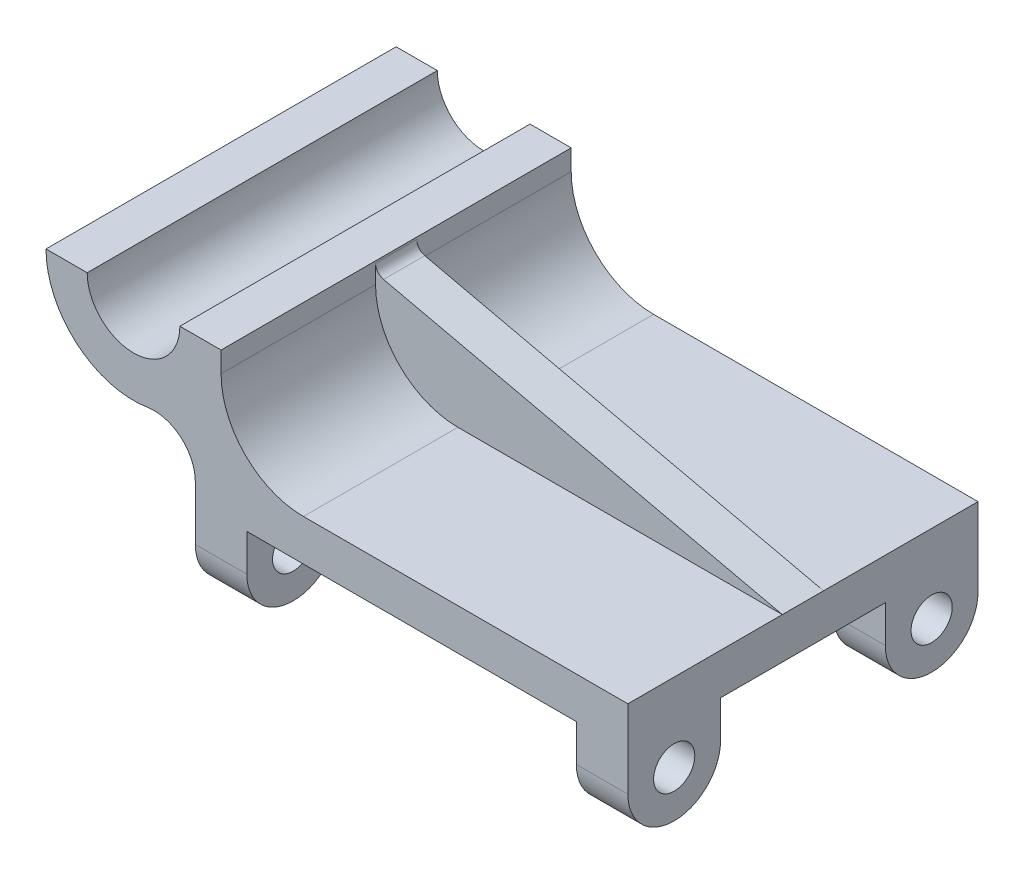
ISO-10303-21;
HEADER;
FILE_DESCRIPTION(('STEP AP214'),'2;1');
FILE_NAME('part.step','',(''),(''),'','','');
FILE_SCHEMA(('AUTOMOTIVE_DESIGN { 1 0 10303 214 1 1 1 1 }'));
ENDSEC;
DATA;
#1=APPLICATION_CONTEXT('core data for automotive mechanical design processes');
#2=APPLICATION_PROTOCOL_DEFINITION('international standard','automotive_design',2000,#1);
#3=PRODUCT_CONTEXT('',#1,'mechanical');
#4=PRODUCT('Part','Part','',(#3));
#5=PRODUCT_RELATED_PRODUCT_CATEGORY('part','',(#4));
#6=PRODUCT_DEFINITION_FORMATION('','',#4);
#7=PRODUCT_DEFINITION_CONTEXT('part definition',#1,'design');
#8=PRODUCT_DEFINITION('design','',#6,#7);
#9=PRODUCT_DEFINITION_SHAPE('','',#8);
#10=(LENGTH_UNIT() NAMED_UNIT(*) SI_UNIT(.MILLI.,.METRE.));
#11=(NAMED_UNIT(*) PLANE_ANGLE_UNIT() SI_UNIT($,.RADIAN.));
#12=(NAMED_UNIT(*) SI_UNIT($,.STERADIAN.) SOLID_ANGLE_UNIT());
#13=UNCERTAINTY_MEASURE_WITH_UNIT(LENGTH_MEASURE(1.E-05),#10,'distance_accuracy_value','');
#14=(GEOMETRIC_REPRESENTATION_CONTEXT(3) GLOBAL_UNCERTAINTY_ASSIGNED_CONTEXT((#13)) GLOBAL_UNIT_ASSIGNED_CONTEXT((#10,
#11,#12)) REPRESENTATION_CONTEXT('',''));
#15=CARTESIAN_POINT('',(0.,0.,0.));
#16=DIRECTION('',(0.,0.,1.));
#17=DIRECTION('',(1.,0.,0.));
#18=AXIS2_PLACEMENT_3D('',#15,#16,#17);
#19=CARTESIAN_POINT('',(20.6375,38.1,53.975));
#20=DIRECTION('',(0.,0.,-1.));
#21=DIRECTION('',(-1.,0.,0.));
#22=AXIS2_PLACEMENT_3D('',#19,#20,#21);
#23=CYLINDRICAL_SURFACE('',#22,25.4);
#24=CARTESIAN_POINT('',(20.6375,38.1,-6.35));
#25=DIRECTION('',(0.,0.,1.));
#26=DIRECTION('',(1.,0.,0.));
#27=AXIS2_PLACEMENT_3D('',#24,#25,#26);
#28=CIRCLE('',#27,25.4);
#29=CARTESIAN_POINT('',(20.6375000000002,12.7,-6.35));
#30=VERTEX_POINT('',#29);
#31=CARTESIAN_POINT('',(-4.76250000000001,38.1000000000002,-6.35));
#32=VERTEX_POINT('',#31);
#33=EDGE_CURVE('E234',#30,#32,#28,.F.);
#34=ORIENTED_EDGE('',*,*,#33,.F.);
#35=DIRECTION('',(0.,0.,-1.));
#36=VECTOR('',#35,1.);
#37=CARTESIAN_POINT('',(20.6375000000002,12.7,53.975));
#38=LINE('',#37,#36);
#39=CARTESIAN_POINT('',(20.6375000000002,12.7,-53.975));
#40=VERTEX_POINT('',#39);
#41=EDGE_CURVE('E218',#30,#40,#38,.T.);
#42=ORIENTED_EDGE('',*,*,#41,.T.);
#43=CARTESIAN_POINT('',(20.6375,38.1,-53.975));
#44=DIRECTION('',(0.,0.,-1.));
#45=DIRECTION('',(-1.,0.,0.));
#46=AXIS2_PLACEMENT_3D('',#43,#44,#45);
#47=CIRCLE('',#46,25.4);
#48=CARTESIAN_POINT('',(-4.76250000000001,38.1000000000002,-53.975));
#49=VERTEX_POINT('',#48);
#50=EDGE_CURVE('E534',#40,#49,#47,.T.);
#51=ORIENTED_EDGE('',*,*,#50,.T.);
#52=DIRECTION('',(0.,0.,-1.));
#53=VECTOR('',#52,1.);
#54=CARTESIAN_POINT('',(-4.76250000000001,38.1000000000002,53.975));
#55=LINE('',#54,#53);
#56=EDGE_CURVE('E235',#32,#49,#55,.T.);
#57=ORIENTED_EDGE('',*,*,#56,.F.);
#58=EDGE_LOOP('',(#34,#42,#51,#57));
#59=FACE_BOUND('',#58,.T.);
#60=ADVANCED_FACE('F33',(#59),#23,.F.);
#61=CARTESIAN_POINT('',(120.65,12.7,53.975));
#62=DIRECTION('',(0.,-1.,0.));
#63=DIRECTION('',(1.,0.,0.));
#64=AXIS2_PLACEMENT_3D('',#61,#62,#63);
#65=PLANE('',#64);
#66=DIRECTION('',(-1.,0.,0.));
#67=VECTOR('',#66,1.);
#68=CARTESIAN_POINT('',(120.65,12.7,-6.35));
#69=LINE('',#68,#67);
#70=CARTESIAN_POINT('',(120.65,12.7,-6.35));
#71=VERTEX_POINT('',#70);
#72=EDGE_CURVE('E222',#71,#30,#69,.T.);
#73=ORIENTED_EDGE('',*,*,#72,.F.);
#74=DIRECTION('',(0.,0.,-1.));
#75=VECTOR('',#74,1.);
#76=CARTESIAN_POINT('',(120.65,12.7,53.975));
#77=LINE('',#76,#75);
#78=CARTESIAN_POINT('',(120.65,12.7,-53.975));
#79=VERTEX_POINT('',#78);
#80=EDGE_CURVE('E441',#71,#79,#77,.T.);
#81=ORIENTED_EDGE('',*,*,#80,.T.);
#82=DIRECTION('',(-1.,0.,0.));
#83=VECTOR('',#82,1.);
#84=CARTESIAN_POINT('',(120.65,12.7,-53.975));
#85=LINE('',#84,#83);
#86=EDGE_CURVE('E225',#79,#40,#85,.T.);
#87=ORIENTED_EDGE('',*,*,#86,.T.);
#88=ORIENTED_EDGE('',*,*,#41,.F.);
#89=EDGE_LOOP('',(#73,#81,#87,#88));
#90=FACE_BOUND('',#89,.T.);
#91=ADVANCED_FACE('F220',(#90),#65,.F.);
#92=CARTESIAN_POINT('',(-51.1445897855322,-11.4312841621226,25.4));
#93=DIRECTION('',(0.,0.,-1.));
#94=DIRECTION('',(-1.,0.,0.));
#95=AXIS2_PLACEMENT_3D('',#92,#93,#94);
#96=PLANE('',#95);
#97=DIRECTION('',(0.,1.,0.));
#98=VECTOR('',#97,1.);
#99=CARTESIAN_POINT('',(3.175,-11.4312841621226,25.4));
#100=LINE('',#99,#98);
#101=CARTESIAN_POINT('',(3.175,-11.4312841621226,25.4));
#102=VERTEX_POINT('',#101);
#103=CARTESIAN_POINT('',(3.175,0.,25.4));
#104=VERTEX_POINT('',#103);
#105=EDGE_CURVE('E321',#102,#104,#100,.T.);
#106=ORIENTED_EDGE('',*,*,#105,.F.);
#107=DIRECTION('',(1.,0.,0.));
#108=VECTOR('',#107,1.);
#109=CARTESIAN_POINT('',(-51.1445897855322,-11.4312841621226,25.4));
#110=LINE('',#109,#108);
#111=CARTESIAN_POINT('',(-12.7,-11.4312841621226,25.4));
#112=VERTEX_POINT('',#111);
#113=EDGE_CURVE('E368',#112,#102,#110,.T.);
#114=ORIENTED_EDGE('',*,*,#113,.F.);
#115=DIRECTION('',(0.,-1.,0.));
#116=VECTOR('',#115,1.);
#117=CARTESIAN_POINT('',(-12.7,-11.4312841621226,25.4));
#118=LINE('',#117,#116);
#119=CARTESIAN_POINT('',(-12.7,0.,25.4));
#120=VERTEX_POINT('',#119);
#121=EDGE_CURVE('E356',#120,#112,#118,.T.);
#122=ORIENTED_EDGE('',*,*,#121,.F.);
#123=DIRECTION('',(1.,0.,0.));
#124=VECTOR('',#123,1.);
#125=CARTESIAN_POINT('',(-51.1445897855322,0.,25.4));
#126=LINE('',#125,#124);
#127=EDGE_CURVE('E372',#120,#104,#126,.T.);
#128=ORIENTED_EDGE('',*,*,#127,.T.);
#129=EDGE_LOOP('',(#106,#114,#122,#128));
#130=FACE_BOUND('',#129,.T.);
#131=ADVANCED_FACE('F419',(#130),#96,.T.);
#132=CARTESIAN_POINT('',(-51.1445897855322,-11.4312841621226,39.6875));
#133=DIRECTION('',(1.,0.,0.));
#134=DIRECTION('',(0.,0.,-1.));
#135=AXIS2_PLACEMENT_3D('',#132,#133,#134);
#136=CYLINDRICAL_SURFACE('',#135,14.2875);
#137=CARTESIAN_POINT('',(3.175,-11.4312841621226,39.6875));
#138=DIRECTION('',(-1.,0.,0.));
#139=DIRECTION('',(0.,0.,1.));
#140=AXIS2_PLACEMENT_3D('',#137,#138,#139);
#141=CIRCLE('',#140,14.2875);
#142=CARTESIAN_POINT('',(3.175,-11.4312841621226,53.975));
#143=VERTEX_POINT('',#142);
#144=EDGE_CURVE('E319',#143,#102,#141,.F.);
#145=ORIENTED_EDGE('',*,*,#144,.F.);
#146=DIRECTION('',(1.,0.,0.));
#147=VECTOR('',#146,1.);
#148=CARTESIAN_POINT('',(-51.1445897855322,-11.4312841621226,53.975));
#149=LINE('',#148,#147);
#150=CARTESIAN_POINT('',(-12.7,-11.4312841621226,53.975));
#151=VERTEX_POINT('',#150);
#152=EDGE_CURVE('E357',#151,#143,#149,.T.);
#153=ORIENTED_EDGE('',*,*,#152,.F.);
#154=CARTESIAN_POINT('',(-12.7,-11.4312841621226,39.6875));
#155=DIRECTION('',(1.,0.,0.));
#156=DIRECTION('',(0.,0.,-1.));
#157=AXIS2_PLACEMENT_3D('',#154,#155,#156);
#158=CIRCLE('',#157,14.2875);
#159=EDGE_CURVE('E353',#112,#151,#158,.F.);
#160=ORIENTED_EDGE('',*,*,#159,.F.);
#161=ORIENTED_EDGE('',*,*,#113,.T.);
#162=EDGE_LOOP('',(#145,#153,#160,#161));
#163=FACE_BOUND('',#162,.T.);
#164=ADVANCED_FACE('F571',(#163),#136,.T.);
#165=CARTESIAN_POINT('',(-51.1445897855322,-11.4312841621226,39.6875));
#166=DIRECTION('',(1.,0.,0.));
#167=DIRECTION('',(0.,0.,-1.));
#168=AXIS2_PLACEMENT_3D('',#165,#166,#167);
#169=CYLINDRICAL_SURFACE('',#168,6.35);
#170=CARTESIAN_POINT('',(3.175,-11.4312841621226,39.6875));
#171=DIRECTION('',(-1.,0.,0.));
#172=DIRECTION('',(0.,0.,1.));
#173=AXIS2_PLACEMENT_3D('',#170,#171,#172);
#174=CIRCLE('',#173,6.35);
#175=CARTESIAN_POINT('',(3.175,-11.4312841621226,46.0375));
#176=VERTEX_POINT('',#175);
#177=EDGE_CURVE('E316',#176,#176,#174,.F.);
#178=ORIENTED_EDGE('',*,*,#177,.T.);
#179=EDGE_LOOP('',(#178));
#180=FACE_BOUND('',#179,.T.);
#181=CARTESIAN_POINT('',(-12.7,-11.4312841621226,39.6875));
#182=DIRECTION('',(1.,0.,0.));
#183=DIRECTION('',(0.,0.,-1.));
#184=AXIS2_PLACEMENT_3D('',#181,#182,#183);
#185=CIRCLE('',#184,6.35);
#186=CARTESIAN_POINT('',(-12.7,-11.4312841621226,33.3375));
#187=VERTEX_POINT('',#186);
#188=EDGE_CURVE('E385',#187,#187,#185,.F.);
#189=ORIENTED_EDGE('',*,*,#188,.T.);
#190=EDGE_LOOP('',(#189));
#191=FACE_BOUND('',#190,.T.);
#192=ADVANCED_FACE('F583',(#180,#191),#169,.F.);
#193=CARTESIAN_POINT('',(-51.1445897855322,-11.4312841621226,-25.4));
#194=DIRECTION('',(0.,0.,1.));
#195=DIRECTION('',(1.,0.,0.));
#196=AXIS2_PLACEMENT_3D('',#193,#194,#195);
#197=PLANE('',#196);
#198=DIRECTION('',(0.,-1.,0.));
#199=VECTOR('',#198,1.);
#200=CARTESIAN_POINT('',(3.175,-11.4312841621226,-25.4));
#201=LINE('',#200,#199);
#202=CARTESIAN_POINT('',(3.175,0.,-25.4));
#203=VERTEX_POINT('',#202);
#204=CARTESIAN_POINT('',(3.175,-11.4312841621226,-25.4));
#205=VERTEX_POINT('',#204);
#206=EDGE_CURVE('E314',#203,#205,#201,.T.);
#207=ORIENTED_EDGE('',*,*,#206,.F.);
#208=DIRECTION('',(1.,0.,0.));
#209=VECTOR('',#208,1.);
#210=CARTESIAN_POINT('',(-51.1445897855322,0.,-25.4));
#211=LINE('',#210,#209);
#212=CARTESIAN_POINT('',(-12.7,0.,-25.4));
#213=VERTEX_POINT('',#212);
#214=EDGE_CURVE('E343',#213,#203,#211,.T.);
#215=ORIENTED_EDGE('',*,*,#214,.F.);
#216=DIRECTION('',(0.,1.,0.));
#217=VECTOR('',#216,1.);
#218=CARTESIAN_POINT('',(-12.7,-11.4312841621226,-25.4));
#219=LINE('',#218,#217);
#220=CARTESIAN_POINT('',(-12.7,-11.4312841621226,-25.4));
#221=VERTEX_POINT('',#220);
#222=EDGE_CURVE('E324',#221,#213,#219,.T.);
#223=ORIENTED_EDGE('',*,*,#222,.F.);
#224=DIRECTION('',(1.,0.,0.));
#225=VECTOR('',#224,1.);
#226=CARTESIAN_POINT('',(-51.1445897855322,-11.4312841621226,-25.4));
#227=LINE('',#226,#225);
#228=EDGE_CURVE('E328',#221,#205,#227,.T.);
#229=ORIENTED_EDGE('',*,*,#228,.T.);
#230=EDGE_LOOP('',(#207,#215,#223,#229));
#231=FACE_BOUND('',#230,.T.);
#232=ADVANCED_FACE('F481',(#231),#197,.T.);
#233=CARTESIAN_POINT('',(-51.1445897855322,-11.4312841621226,-39.6875));
#234=DIRECTION('',(1.,0.,0.));
#235=DIRECTION('',(0.,0.,-1.));
#236=AXIS2_PLACEMENT_3D('',#233,#234,#235);
#237=CYLINDRICAL_SURFACE('',#236,14.2875);
#238=DIRECTION('',(1.,0.,0.));
#239=VECTOR('',#238,1.);
#240=CARTESIAN_POINT('',(-51.1445897855322,-11.4312841621226,-53.975));
#241=LINE('',#240,#239);
#242=CARTESIAN_POINT('',(-12.7,-11.4312841621226,-53.975));
#243=VERTEX_POINT('',#242);
#244=CARTESIAN_POINT('',(3.175,-11.4312841621226,-53.975));
#245=VERTEX_POINT('',#244);
#246=EDGE_CURVE('E347',#243,#245,#241,.T.);
#247=ORIENTED_EDGE('',*,*,#246,.T.);
#248=CARTESIAN_POINT('',(3.175,-11.4312841621226,-39.6875));
#249=DIRECTION('',(-1.,0.,0.));
#250=DIRECTION('',(0.,0.,1.));
#251=AXIS2_PLACEMENT_3D('',#248,#249,#250);
#252=CIRCLE('',#251,14.2875);
#253=EDGE_CURVE('E312',#205,#245,#252,.F.);
#254=ORIENTED_EDGE('',*,*,#253,.F.);
#255=ORIENTED_EDGE('',*,*,#228,.F.);
#256=CARTESIAN_POINT('',(-12.7,-11.4312841621226,-39.6875));
#257=DIRECTION('',(1.,0.,0.));
#258=DIRECTION('',(0.,0.,-1.));
#259=AXIS2_PLACEMENT_3D('',#256,#257,#258);
#260=CIRCLE('',#259,14.2875);
#261=EDGE_CURVE('E327',#243,#221,#260,.F.);
#262=ORIENTED_EDGE('',*,*,#261,.F.);
#263=EDGE_LOOP('',(#247,#254,#255,#262));
#264=FACE_BOUND('',#263,.T.);
#265=ADVANCED_FACE('F485',(#264),#237,.T.);
#266=CARTESIAN_POINT('',(-51.1445897855322,-11.4312841621226,-39.6875));
#267=DIRECTION('',(1.,0.,0.));
#268=DIRECTION('',(0.,0.,-1.));
#269=AXIS2_PLACEMENT_3D('',#266,#267,#268);
#270=CYLINDRICAL_SURFACE('',#269,6.35);
#271=CARTESIAN_POINT('',(3.175,-11.4312841621226,-39.6875));
#272=DIRECTION('',(-1.,0.,0.));
#273=DIRECTION('',(0.,0.,1.));
#274=AXIS2_PLACEMENT_3D('',#271,#272,#273);
#275=CIRCLE('',#274,6.35);
#276=CARTESIAN_POINT('',(3.175,-11.4312841621226,-33.3375));
#277=VERTEX_POINT('',#276);
#278=EDGE_CURVE('E311',#277,#277,#275,.F.);
#279=ORIENTED_EDGE('',*,*,#278,.T.);
#280=EDGE_LOOP('',(#279));
#281=FACE_BOUND('',#280,.T.);
#282=CARTESIAN_POINT('',(-12.7,-11.4312841621226,-39.6875));
#283=DIRECTION('',(1.,0.,0.));
#284=DIRECTION('',(0.,0.,-1.));
#285=AXIS2_PLACEMENT_3D('',#282,#283,#284);
#286=CIRCLE('',#285,6.35);
#287=CARTESIAN_POINT('',(-12.7,-11.4312841621226,-46.0375));
#288=VERTEX_POINT('',#287);
#289=EDGE_CURVE('E330',#288,#288,#286,.F.);
#290=ORIENTED_EDGE('',*,*,#289,.T.);
#291=EDGE_LOOP('',(#290));
#292=FACE_BOUND('',#291,.T.);
#293=ADVANCED_FACE('F392',(#281,#292),#270,.F.);
#294=CARTESIAN_POINT('',(120.65,0.,53.975));
#295=DIRECTION('',(0.,1.,0.));
#296=DIRECTION('',(0.,0.,1.));
#297=AXIS2_PLACEMENT_3D('',#294,#295,#296);
#298=PLANE('',#297);
#299=DIRECTION('',(0.,0.,-1.));
#300=VECTOR('',#299,1.);
#301=CARTESIAN_POINT('',(-12.7,0.,53.975));
#302=LINE('',#301,#300);
#303=EDGE_CURVE('E376',#120,#213,#302,.T.);
#304=ORIENTED_EDGE('',*,*,#303,.T.);
#305=ORIENTED_EDGE('',*,*,#214,.T.);
#306=DIRECTION('',(0.,0.,1.));
#307=VECTOR('',#306,1.);
#308=CARTESIAN_POINT('',(3.175,0.,-53.975));
#309=LINE('',#308,#307);
#310=CARTESIAN_POINT('',(3.175,0.,-53.975));
#311=VERTEX_POINT('',#310);
#312=EDGE_CURVE('E293',#311,#203,#309,.T.);
#313=ORIENTED_EDGE('',*,*,#312,.F.);
#314=DIRECTION('',(-1.,0.,0.));
#315=VECTOR('',#314,1.);
#316=CARTESIAN_POINT('',(3.175,0.,-53.975));
#317=LINE('',#316,#315);
#318=CARTESIAN_POINT('',(104.775,0.,-53.975));
#319=VERTEX_POINT('',#318);
#320=EDGE_CURVE('E282',#319,#311,#317,.T.);
#321=ORIENTED_EDGE('',*,*,#320,.F.);
#322=DIRECTION('',(0.,0.,1.));
#323=VECTOR('',#322,1.);
#324=CARTESIAN_POINT('',(104.775,0.,-53.975));
#325=LINE('',#324,#323);
#326=CARTESIAN_POINT('',(104.775,0.,-25.4));
#327=VERTEX_POINT('',#326);
#328=EDGE_CURVE('E297',#319,#327,#325,.T.);
#329=ORIENTED_EDGE('',*,*,#328,.T.);
#330=CARTESIAN_POINT('',(120.65,0.,-25.4));
#331=VERTEX_POINT('',#330);
#332=EDGE_CURVE('E346',#327,#331,#211,.T.);
#333=ORIENTED_EDGE('',*,*,#332,.T.);
#334=DIRECTION('',(0.,0.,-1.));
#335=VECTOR('',#334,1.);
#336=CARTESIAN_POINT('',(120.65,0.,53.975));
#337=LINE('',#336,#335);
#338=CARTESIAN_POINT('',(120.65,0.,25.4));
#339=VERTEX_POINT('',#338);
#340=EDGE_CURVE('E449',#339,#331,#337,.T.);
#341=ORIENTED_EDGE('',*,*,#340,.F.);
#342=CARTESIAN_POINT('',(104.775,0.,25.4));
#343=VERTEX_POINT('',#342);
#344=EDGE_CURVE('E249',#343,#339,#126,.T.);
#345=ORIENTED_EDGE('',*,*,#344,.F.);
#346=CARTESIAN_POINT('',(104.775,0.,53.975));
#347=VERTEX_POINT('',#346);
#348=EDGE_CURVE('E285',#343,#347,#325,.T.);
#349=ORIENTED_EDGE('',*,*,#348,.T.);
#350=DIRECTION('',(-1.,0.,0.));
#351=VECTOR('',#350,1.);
#352=CARTESIAN_POINT('',(3.175,0.,53.975));
#353=LINE('',#352,#351);
#354=CARTESIAN_POINT('',(3.175,0.,53.975));
#355=VERTEX_POINT('',#354);
#356=EDGE_CURVE('E279',#347,#355,#353,.T.);
#357=ORIENTED_EDGE('',*,*,#356,.T.);
#358=EDGE_CURVE('E296',#104,#355,#309,.T.);
#359=ORIENTED_EDGE('',*,*,#358,.F.);
#360=ORIENTED_EDGE('',*,*,#127,.F.);
#361=EDGE_LOOP('',(#304,#305,#313,#321,#329,#333,#341,#345,#349,#357,#359,#360));
#362=FACE_BOUND('',#361,.T.);
#363=ADVANCED_FACE('F424',(#362),#298,.F.);
#364=CARTESIAN_POINT('',(20.6375000000002,12.7,53.975));
#365=VERTEX_POINT('',#364);
#366=CARTESIAN_POINT('',(20.6375000000002,12.7,6.35));
#367=VERTEX_POINT('',#366);
#368=EDGE_CURVE('E229',#365,#367,#38,.T.);
#369=ORIENTED_EDGE('',*,*,#368,.T.);
#370=CARTESIAN_POINT('',(20.6375,38.1,6.35));
#371=DIRECTION('',(0.,0.,1.));
#372=DIRECTION('',(1.,0.,0.));
#373=AXIS2_PLACEMENT_3D('',#370,#371,#372);
#374=CIRCLE('',#373,25.4);
#375=CARTESIAN_POINT('',(-4.76250000000001,38.1000000000002,6.35));
#376=VERTEX_POINT('',#375);
#377=EDGE_CURVE('E271',#367,#376,#374,.F.);
#378=ORIENTED_EDGE('',*,*,#377,.T.);
#379=CARTESIAN_POINT('',(-4.76250000000001,38.1000000000002,53.975));
#380=VERTEX_POINT('',#379);
#381=EDGE_CURVE('E242',#380,#376,#55,.T.);
#382=ORIENTED_EDGE('',*,*,#381,.F.);
#383=CARTESIAN_POINT('',(20.6375,38.1,53.975));
#384=DIRECTION('',(0.,0.,-1.));
#385=DIRECTION('',(-1.,0.,0.));
#386=AXIS2_PLACEMENT_3D('',#383,#384,#385);
#387=CIRCLE('',#386,25.4);
#388=EDGE_CURVE('E438',#365,#380,#387,.T.);
#389=ORIENTED_EDGE('',*,*,#388,.F.);
#390=EDGE_LOOP('',(#369,#378,#382,#389));
#391=FACE_BOUND('',#390,.T.);
#392=ADVANCED_FACE('F415',(#391),#23,.F.);
#393=CARTESIAN_POINT('',(-4.76250000000001,44.45,53.975));
#394=DIRECTION('',(-1.,0.,0.));
#395=DIRECTION('',(0.,0.,1.));
#396=AXIS2_PLACEMENT_3D('',#393,#394,#395);
#397=PLANE('',#396);
#398=DIRECTION('',(0.,0.,-1.));
#399=VECTOR('',#398,1.);
#400=CARTESIAN_POINT('',(-4.76250000000001,43.8079542166674,53.975));
#401=LINE('',#400,#399);
#402=CARTESIAN_POINT('',(-4.76250000000001,43.8079542166674,6.35));
#403=VERTEX_POINT('',#402);
#404=CARTESIAN_POINT('',(-4.76250000000001,43.8079542166674,-6.35));
#405=VERTEX_POINT('',#404);
#406=EDGE_CURVE('E244',#403,#405,#401,.T.);
#407=ORIENTED_EDGE('',*,*,#406,.T.);
#408=DIRECTION('',(0.,1.,0.));
#409=VECTOR('',#408,1.);
#410=CARTESIAN_POINT('',(-4.76250000000001,44.45,-6.35));
#411=LINE('',#410,#409);
#412=EDGE_CURVE('E236',#32,#405,#411,.T.);
#413=ORIENTED_EDGE('',*,*,#412,.F.);
#414=ORIENTED_EDGE('',*,*,#56,.T.);
#415=DIRECTION('',(0.,1.,0.));
#416=VECTOR('',#415,1.);
#417=CARTESIAN_POINT('',(-4.76250000000001,44.45,-53.975));
#418=LINE('',#417,#416);
#419=CARTESIAN_POINT('',(-4.76250000000001,44.45,-53.975));
#420=VERTEX_POINT('',#419);
#421=EDGE_CURVE('E536',#49,#420,#418,.T.);
#422=ORIENTED_EDGE('',*,*,#421,.T.);
#423=DIRECTION('',(0.,0.,-1.));
#424=VECTOR('',#423,1.);
#425=CARTESIAN_POINT('',(-4.76250000000001,44.45,53.975));
#426=LINE('',#425,#424);
#427=CARTESIAN_POINT('',(-4.76250000000001,44.45,53.975));
#428=VERTEX_POINT('',#427);
#429=EDGE_CURVE('E454',#428,#420,#426,.T.);
#430=ORIENTED_EDGE('',*,*,#429,.F.);
#431=DIRECTION('',(0.,1.,0.));
#432=VECTOR('',#431,1.);
#433=CARTESIAN_POINT('',(-4.76250000000001,44.45,53.975));
#434=LINE('',#433,#432);
#435=EDGE_CURVE('E553',#380,#428,#434,.T.);
#436=ORIENTED_EDGE('',*,*,#435,.F.);
#437=ORIENTED_EDGE('',*,*,#381,.T.);
#438=DIRECTION('',(0.,1.,0.));
#439=VECTOR('',#438,1.);
#440=CARTESIAN_POINT('',(-4.76250000000001,44.45,6.35));
#441=LINE('',#440,#439);
#442=EDGE_CURVE('E259',#376,#403,#441,.T.);
#443=ORIENTED_EDGE('',*,*,#442,.T.);
#444=EDGE_LOOP('',(#407,#413,#414,#422,#430,#436,#437,#443));
#445=FACE_BOUND('',#444,.T.);
#446=ADVANCED_FACE('F257',(#445),#397,.F.);
#447=CARTESIAN_POINT('',(-17.4625,44.45,53.975));
#448=DIRECTION('',(0.,-1.,0.));
#449=DIRECTION('',(0.,0.,-1.));
#450=AXIS2_PLACEMENT_3D('',#447,#448,#449);
#451=PLANE('',#450);
#452=DIRECTION('',(-1.,0.,0.));
#453=VECTOR('',#452,1.);
#454=CARTESIAN_POINT('',(-17.4625,44.45,-53.975));
#455=LINE('',#454,#453);
#456=CARTESIAN_POINT('',(-17.4625,44.45,-53.975));
#457=VERTEX_POINT('',#456);
#458=EDGE_CURVE('E538',#420,#457,#455,.T.);
#459=ORIENTED_EDGE('',*,*,#458,.T.);
#460=DIRECTION('',(0.,0.,-1.));
#461=VECTOR('',#460,1.);
#462=CARTESIAN_POINT('',(-17.4625,44.45,53.975));
#463=LINE('',#462,#461);
#464=CARTESIAN_POINT('',(-17.4625,44.45,53.975));
#465=VERTEX_POINT('',#464);
#466=EDGE_CURVE('E457',#465,#457,#463,.T.);
#467=ORIENTED_EDGE('',*,*,#466,.F.);
#468=DIRECTION('',(-1.,0.,0.));
#469=VECTOR('',#468,1.);
#470=CARTESIAN_POINT('',(-17.4625,44.45,53.975));
#471=LINE('',#470,#469);
#472=EDGE_CURVE('E555',#428,#465,#471,.T.);
#473=ORIENTED_EDGE('',*,*,#472,.F.);
#474=ORIENTED_EDGE('',*,*,#429,.T.);
#475=EDGE_LOOP('',(#459,#467,#473,#474));
#476=FACE_BOUND('',#475,.T.);
#477=ADVANCED_FACE('F430',(#476),#451,.F.);
#478=CARTESIAN_POINT('',(-31.75,44.45,53.975));
#479=DIRECTION('',(0.,0.,-1.));
#480=DIRECTION('',(-1.,0.,0.));
#481=AXIS2_PLACEMENT_3D('',#478,#479,#480);
#482=CYLINDRICAL_SURFACE('',#481,14.2875);
#483=CARTESIAN_POINT('',(-31.75,44.45,-53.975));
#484=DIRECTION('',(0.,0.,-1.));
#485=DIRECTION('',(1.,0.,0.));
#486=AXIS2_PLACEMENT_3D('',#483,#484,#485);
#487=CIRCLE('',#486,14.2875);
#488=CARTESIAN_POINT('',(-46.0375,44.45,-53.975));
#489=VERTEX_POINT('',#488);
#490=EDGE_CURVE('E540',#457,#489,#487,.T.);
#491=ORIENTED_EDGE('',*,*,#490,.T.);
#492=DIRECTION('',(0.,0.,-1.));
#493=VECTOR('',#492,1.);
#494=CARTESIAN_POINT('',(-46.0375,44.45,53.975));
#495=LINE('',#494,#493);
#496=CARTESIAN_POINT('',(-46.0375,44.45,53.975));
#497=VERTEX_POINT('',#496);
#498=EDGE_CURVE('E460',#497,#489,#495,.T.);
#499=ORIENTED_EDGE('',*,*,#498,.F.);
#500=CARTESIAN_POINT('',(-31.75,44.45,53.975));
#501=DIRECTION('',(0.,0.,-1.));
#502=DIRECTION('',(1.,0.,0.));
#503=AXIS2_PLACEMENT_3D('',#500,#501,#502);
#504=CIRCLE('',#503,14.2875);
#505=EDGE_CURVE('E559',#465,#497,#504,.T.);
#506=ORIENTED_EDGE('',*,*,#505,.F.);
#507=ORIENTED_EDGE('',*,*,#466,.T.);
#508=EDGE_LOOP('',(#491,#499,#506,#507));
#509=FACE_BOUND('',#508,.T.);
#510=ADVANCED_FACE('F612',(#509),#482,.F.);
#511=CARTESIAN_POINT('',(-58.7375,44.45,53.975));
#512=DIRECTION('',(0.,-1.,0.));
#513=DIRECTION('',(0.,0.,-1.));
#514=AXIS2_PLACEMENT_3D('',#511,#512,#513);
#515=PLANE('',#514);
#516=ORIENTED_EDGE('',*,*,#498,.T.);
#517=DIRECTION('',(-1.,0.,0.));
#518=VECTOR('',#517,1.);
#519=CARTESIAN_POINT('',(-58.7375,44.45,-53.975));
#520=LINE('',#519,#518);
#521=CARTESIAN_POINT('',(-58.7375,44.45,-53.975));
#522=VERTEX_POINT('',#521);
#523=EDGE_CURVE('E543',#489,#522,#520,.T.);
#524=ORIENTED_EDGE('',*,*,#523,.T.);
#525=DIRECTION('',(0.,0.,-1.));
#526=VECTOR('',#525,1.);
#527=CARTESIAN_POINT('',(-58.7375,44.45,53.975));
#528=LINE('',#527,#526);
#529=CARTESIAN_POINT('',(-58.7375,44.45,53.975));
#530=VERTEX_POINT('',#529);
#531=EDGE_CURVE('E462',#530,#522,#528,.T.);
#532=ORIENTED_EDGE('',*,*,#531,.F.);
#533=DIRECTION('',(-1.,0.,0.));
#534=VECTOR('',#533,1.);
#535=CARTESIAN_POINT('',(-58.7375,44.45,53.975));
#536=LINE('',#535,#534);
#537=EDGE_CURVE('E561',#497,#530,#536,.T.);
#538=ORIENTED_EDGE('',*,*,#537,.F.);
#539=EDGE_LOOP('',(#516,#524,#532,#538));
#540=FACE_BOUND('',#539,.T.);
#541=ADVANCED_FACE('F608',(#540),#515,.F.);
#542=CARTESIAN_POINT('',(-31.75,44.45,53.975));
#543=DIRECTION('',(0.,0.,-1.));
#544=DIRECTION('',(-1.,0.,0.));
#545=AXIS2_PLACEMENT_3D('',#542,#543,#544);
#546=CYLINDRICAL_SURFACE('',#545,26.9875);
#547=ORIENTED_EDGE('',*,*,#531,.T.);
#548=CARTESIAN_POINT('',(-31.75,44.45,-53.975));
#549=DIRECTION('',(0.,0.,1.));
#550=DIRECTION('',(1.,0.,0.));
#551=AXIS2_PLACEMENT_3D('',#548,#549,#550);
#552=CIRCLE('',#551,26.9875);
#553=CARTESIAN_POINT('',(-27.432,17.8101795754926,-53.975));
#554=VERTEX_POINT('',#553);
#555=EDGE_CURVE('E546',#522,#554,#552,.T.);
#556=ORIENTED_EDGE('',*,*,#555,.T.);
#557=DIRECTION('',(0.,0.,-1.));
#558=VECTOR('',#557,1.);
#559=CARTESIAN_POINT('',(-27.432,17.8101795754926,53.975));
#560=LINE('',#559,#558);
#561=CARTESIAN_POINT('',(-27.432,17.8101795754926,53.975));
#562=VERTEX_POINT('',#561);
#563=EDGE_CURVE('E464',#562,#554,#560,.T.);
#564=ORIENTED_EDGE('',*,*,#563,.F.);
#565=CARTESIAN_POINT('',(-31.75,44.45,53.975));
#566=DIRECTION('',(0.,0.,1.));
#567=DIRECTION('',(1.,0.,0.));
#568=AXIS2_PLACEMENT_3D('',#565,#566,#567);
#569=CIRCLE('',#568,26.9875);
#570=EDGE_CURVE('E563',#530,#562,#569,.T.);
#571=ORIENTED_EDGE('',*,*,#570,.F.);
#572=EDGE_LOOP('',(#547,#556,#564,#571));
#573=FACE_BOUND('',#572,.T.);
#574=ADVANCED_FACE('F605',(#573),#546,.T.);
#575=CARTESIAN_POINT('',(-25.4,5.27379349337151,53.975));
#576=DIRECTION('',(0.,0.,-1.));
#577=DIRECTION('',(-1.,0.,0.));
#578=AXIS2_PLACEMENT_3D('',#575,#576,#577);
#579=CYLINDRICAL_SURFACE('',#578,12.7);
#580=ORIENTED_EDGE('',*,*,#563,.T.);
#581=CARTESIAN_POINT('',(-25.4,5.27379349337151,-53.975));
#582=DIRECTION('',(0.,0.,-1.));
#583=DIRECTION('',(1.,0.,0.));
#584=AXIS2_PLACEMENT_3D('',#581,#582,#583);
#585=CIRCLE('',#584,12.7);
#586=CARTESIAN_POINT('',(-12.7,5.27379349337151,-53.975));
#587=VERTEX_POINT('',#586);
#588=EDGE_CURVE('E549',#554,#587,#585,.T.);
#589=ORIENTED_EDGE('',*,*,#588,.T.);
#590=DIRECTION('',(0.,0.,-1.));
#591=VECTOR('',#590,1.);
#592=CARTESIAN_POINT('',(-12.7,5.27379349337151,53.975));
#593=LINE('',#592,#591);
#594=CARTESIAN_POINT('',(-12.7,5.27379349337151,53.975));
#595=VERTEX_POINT('',#594);
#596=EDGE_CURVE('E465',#595,#587,#593,.T.);
#597=ORIENTED_EDGE('',*,*,#596,.F.);
#598=CARTESIAN_POINT('',(-25.4,5.27379349337151,53.975));
#599=DIRECTION('',(0.,0.,-1.));
#600=DIRECTION('',(1.,0.,0.));
#601=AXIS2_PLACEMENT_3D('',#598,#599,#600);
#602=CIRCLE('',#601,12.7);
#603=EDGE_CURVE('E530',#562,#595,#602,.T.);
#604=ORIENTED_EDGE('',*,*,#603,.F.);
#605=EDGE_LOOP('',(#580,#589,#597,#604));
#606=FACE_BOUND('',#605,.T.);
#607=ADVANCED_FACE('F569',(#606),#579,.F.);
#608=CARTESIAN_POINT('',(-12.7,5.27379349337151,53.975));
#609=DIRECTION('',(1.,0.,0.));
#610=DIRECTION('',(0.,0.,-1.));
#611=AXIS2_PLACEMENT_3D('',#608,#609,#610);
#612=PLANE('',#611);
#613=ORIENTED_EDGE('',*,*,#596,.T.);
#614=DIRECTION('',(0.,-1.,0.));
#615=VECTOR('',#614,1.);
#616=CARTESIAN_POINT('',(-12.7,5.27379349337151,-53.975));
#617=LINE('',#616,#615);
#618=EDGE_CURVE('E491',#587,#243,#617,.T.);
#619=ORIENTED_EDGE('',*,*,#618,.T.);
#620=ORIENTED_EDGE('',*,*,#261,.T.);
#621=ORIENTED_EDGE('',*,*,#222,.T.);
#622=ORIENTED_EDGE('',*,*,#303,.F.);
#623=ORIENTED_EDGE('',*,*,#121,.T.);
#624=ORIENTED_EDGE('',*,*,#159,.T.);
#625=DIRECTION('',(0.,-1.,0.));
#626=VECTOR('',#625,1.);
#627=CARTESIAN_POINT('',(-12.7,5.27379349337151,53.975));
#628=LINE('',#627,#626);
#629=EDGE_CURVE('E527',#595,#151,#628,.T.);
#630=ORIENTED_EDGE('',*,*,#629,.F.);
#631=EDGE_LOOP('',(#613,#619,#620,#621,#622,#623,#624,#630));
#632=FACE_BOUND('',#631,.T.);
#633=ORIENTED_EDGE('',*,*,#188,.F.);
#634=EDGE_LOOP('',(#633));
#635=FACE_BOUND('',#634,.T.);
#636=ORIENTED_EDGE('',*,*,#289,.F.);
#637=EDGE_LOOP('',(#636));
#638=FACE_BOUND('',#637,.T.);
#639=ADVANCED_FACE('F475',(#632,#635,#638),#612,.F.);
#640=CARTESIAN_POINT('',(120.65,0.,53.975));
#641=DIRECTION('',(-1.,0.,0.));
#642=DIRECTION('',(0.,0.,1.));
#643=AXIS2_PLACEMENT_3D('',#640,#641,#642);
#644=PLANE('',#643);
#645=ORIENTED_EDGE('',*,*,#340,.T.);
#646=DIRECTION('',(0.,-1.,0.));
#647=VECTOR('',#646,1.);
#648=CARTESIAN_POINT('',(120.65,-11.4312841621226,-25.4));
#649=LINE('',#648,#647);
#650=CARTESIAN_POINT('',(120.65,-11.4312841621226,-25.4));
#651=VERTEX_POINT('',#650);
#652=EDGE_CURVE('E336',#331,#651,#649,.T.);
#653=ORIENTED_EDGE('',*,*,#652,.T.);
#654=CARTESIAN_POINT('',(120.65,-11.4312841621226,-39.6875));
#655=DIRECTION('',(1.,0.,0.));
#656=DIRECTION('',(0.,0.,1.));
#657=AXIS2_PLACEMENT_3D('',#654,#655,#656);
#658=CIRCLE('',#657,14.2875);
#659=CARTESIAN_POINT('',(120.65,-11.4312841621226,-53.975));
#660=VERTEX_POINT('',#659);
#661=EDGE_CURVE('E333',#651,#660,#658,.T.);
#662=ORIENTED_EDGE('',*,*,#661,.T.);
#663=DIRECTION('',(0.,1.,0.));
#664=VECTOR('',#663,1.);
#665=CARTESIAN_POINT('',(120.65,0.,-53.975));
#666=LINE('',#665,#664);
#667=EDGE_CURVE('E551',#660,#79,#666,.T.);
#668=ORIENTED_EDGE('',*,*,#667,.T.);
#669=ORIENTED_EDGE('',*,*,#80,.F.);
#670=CARTESIAN_POINT('',(120.65,12.7,6.35));
#671=VERTEX_POINT('',#670);
#672=EDGE_CURVE('E442',#671,#71,#77,.T.);
#673=ORIENTED_EDGE('',*,*,#672,.F.);
#674=CARTESIAN_POINT('',(120.65,12.7,53.975));
#675=VERTEX_POINT('',#674);
#676=EDGE_CURVE('E444',#675,#671,#77,.T.);
#677=ORIENTED_EDGE('',*,*,#676,.F.);
#678=DIRECTION('',(0.,1.,0.));
#679=VECTOR('',#678,1.);
#680=CARTESIAN_POINT('',(120.65,0.,53.975));
#681=LINE('',#680,#679);
#682=CARTESIAN_POINT('',(120.65,-11.4312841621226,53.975));
#683=VERTEX_POINT('',#682);
#684=EDGE_CURVE('E525',#683,#675,#681,.T.);
#685=ORIENTED_EDGE('',*,*,#684,.F.);
#686=CARTESIAN_POINT('',(120.65,-11.4312841621226,39.6875));
#687=DIRECTION('',(1.,0.,0.));
#688=DIRECTION('',(0.,0.,-1.));
#689=AXIS2_PLACEMENT_3D('',#686,#687,#688);
#690=CIRCLE('',#689,14.2875);
#691=CARTESIAN_POINT('',(120.65,-11.4312841621226,25.4));
#692=VERTEX_POINT('',#691);
#693=EDGE_CURVE('E360',#683,#692,#690,.T.);
#694=ORIENTED_EDGE('',*,*,#693,.T.);
#695=DIRECTION('',(0.,1.,0.));
#696=VECTOR('',#695,1.);
#697=CARTESIAN_POINT('',(120.65,-11.4312841621226,25.4));
#698=LINE('',#697,#696);
#699=EDGE_CURVE('E363',#692,#339,#698,.T.);
#700=ORIENTED_EDGE('',*,*,#699,.T.);
#701=EDGE_LOOP('',(#645,#653,#662,#668,#669,#673,#677,#685,#694,#700));
#702=FACE_BOUND('',#701,.T.);
#703=CARTESIAN_POINT('',(120.65,-11.4312841621226,39.6875));
#704=DIRECTION('',(1.,0.,0.));
#705=DIRECTION('',(0.,0.,-1.));
#706=AXIS2_PLACEMENT_3D('',#703,#704,#705);
#707=CIRCLE('',#706,6.35);
#708=CARTESIAN_POINT('',(120.65,-11.4312841621226,33.3375));
#709=VERTEX_POINT('',#708);
#710=EDGE_CURVE('E352',#709,#709,#707,.T.);
#711=ORIENTED_EDGE('',*,*,#710,.F.);
#712=EDGE_LOOP('',(#711));
#713=FACE_BOUND('',#712,.T.);
#714=CARTESIAN_POINT('',(120.65,-11.4312841621226,-39.6875));
#715=DIRECTION('',(1.,0.,0.));
#716=DIRECTION('',(0.,0.,1.));
#717=AXIS2_PLACEMENT_3D('',#714,#715,#716);
#718=CIRCLE('',#717,6.35);
#719=CARTESIAN_POINT('',(120.65,-11.4312841621226,-33.3375));
#720=VERTEX_POINT('',#719);
#721=EDGE_CURVE('E323',#720,#720,#718,.T.);
#722=ORIENTED_EDGE('',*,*,#721,.F.);
#723=EDGE_LOOP('',(#722));
#724=FACE_BOUND('',#723,.T.);
#725=ADVANCED_FACE('F505',(#702,#713,#724),#644,.F.);
#726=ORIENTED_EDGE('',*,*,#676,.T.);
#727=DIRECTION('',(-1.,0.,0.));
#728=VECTOR('',#727,1.);
#729=CARTESIAN_POINT('',(120.65,12.7,6.35));
#730=LINE('',#729,#728);
#731=EDGE_CURVE('E241',#671,#367,#730,.T.);
#732=ORIENTED_EDGE('',*,*,#731,.T.);
#733=ORIENTED_EDGE('',*,*,#368,.F.);
#734=DIRECTION('',(-1.,0.,0.));
#735=VECTOR('',#734,1.);
#736=CARTESIAN_POINT('',(120.65,12.7,53.975));
#737=LINE('',#736,#735);
#738=EDGE_CURVE('E230',#675,#365,#737,.T.);
#739=ORIENTED_EDGE('',*,*,#738,.F.);
#740=EDGE_LOOP('',(#726,#732,#733,#739));
#741=FACE_BOUND('',#740,.T.);
#742=ADVANCED_FACE('F421',(#741),#65,.F.);
#743=CARTESIAN_POINT('',(20.6375,38.1,53.975));
#744=DIRECTION('',(0.,0.,-1.));
#745=DIRECTION('',(-1.,0.,0.));
#746=AXIS2_PLACEMENT_3D('',#743,#744,#745);
#747=PLANE('',#746);
#748=ORIENTED_EDGE('',*,*,#152,.T.);
#749=DIRECTION('',(0.,-1.,0.));
#750=VECTOR('',#749,1.);
#751=CARTESIAN_POINT('',(3.175,-25.7187841621226,53.975));
#752=LINE('',#751,#750);
#753=EDGE_CURVE('E274',#355,#143,#752,.T.);
#754=ORIENTED_EDGE('',*,*,#753,.F.);
#755=ORIENTED_EDGE('',*,*,#356,.F.);
#756=DIRECTION('',(0.,1.,0.));
#757=VECTOR('',#756,1.);
#758=CARTESIAN_POINT('',(104.775,-25.7187841621226,53.975));
#759=LINE('',#758,#757);
#760=CARTESIAN_POINT('',(104.775,-11.4312841621226,53.975));
#761=VERTEX_POINT('',#760);
#762=EDGE_CURVE('E288',#761,#347,#759,.T.);
#763=ORIENTED_EDGE('',*,*,#762,.F.);
#764=EDGE_CURVE('E365',#761,#683,#149,.T.);
#765=ORIENTED_EDGE('',*,*,#764,.T.);
#766=ORIENTED_EDGE('',*,*,#684,.T.);
#767=ORIENTED_EDGE('',*,*,#738,.T.);
#768=ORIENTED_EDGE('',*,*,#388,.T.);
#769=ORIENTED_EDGE('',*,*,#435,.T.);
#770=ORIENTED_EDGE('',*,*,#472,.T.);
#771=ORIENTED_EDGE('',*,*,#505,.T.);
#772=ORIENTED_EDGE('',*,*,#537,.T.);
#773=ORIENTED_EDGE('',*,*,#570,.T.);
#774=ORIENTED_EDGE('',*,*,#603,.T.);
#775=ORIENTED_EDGE('',*,*,#629,.T.);
#776=EDGE_LOOP('',(#748,#754,#755,#763,#765,#766,#767,#768,#769,#770,#771,#772,#773,#774,#775));
#777=FACE_BOUND('',#776,.T.);
#778=ADVANCED_FACE('F565',(#777),#747,.F.);
#779=CARTESIAN_POINT('',(20.6375,38.1,-53.975));
#780=DIRECTION('',(0.,0.,-1.));
#781=DIRECTION('',(-1.,0.,0.));
#782=AXIS2_PLACEMENT_3D('',#779,#780,#781);
#783=PLANE('',#782);
#784=DIRECTION('',(0.,-1.,0.));
#785=VECTOR('',#784,1.);
#786=CARTESIAN_POINT('',(3.175,-25.7187841621226,-53.975));
#787=LINE('',#786,#785);
#788=EDGE_CURVE('E275',#311,#245,#787,.T.);
#789=ORIENTED_EDGE('',*,*,#788,.T.);
#790=ORIENTED_EDGE('',*,*,#246,.F.);
#791=ORIENTED_EDGE('',*,*,#618,.F.);
#792=ORIENTED_EDGE('',*,*,#588,.F.);
#793=ORIENTED_EDGE('',*,*,#555,.F.);
#794=ORIENTED_EDGE('',*,*,#523,.F.);
#795=ORIENTED_EDGE('',*,*,#490,.F.);
#796=ORIENTED_EDGE('',*,*,#458,.F.);
#797=ORIENTED_EDGE('',*,*,#421,.F.);
#798=ORIENTED_EDGE('',*,*,#50,.F.);
#799=ORIENTED_EDGE('',*,*,#86,.F.);
#800=ORIENTED_EDGE('',*,*,#667,.F.);
#801=CARTESIAN_POINT('',(104.775,-11.4312841621226,-53.975));
#802=VERTEX_POINT('',#801);
#803=EDGE_CURVE('E339',#802,#660,#241,.T.);
#804=ORIENTED_EDGE('',*,*,#803,.F.);
#805=DIRECTION('',(0.,1.,0.));
#806=VECTOR('',#805,1.);
#807=CARTESIAN_POINT('',(104.775,-25.7187841621226,-53.975));
#808=LINE('',#807,#806);
#809=EDGE_CURVE('E278',#802,#319,#808,.T.);
#810=ORIENTED_EDGE('',*,*,#809,.T.);
#811=ORIENTED_EDGE('',*,*,#320,.T.);
#812=EDGE_LOOP('',(#789,#790,#791,#792,#793,#794,#795,#796,#797,#798,#799,#800,#804,#810,#811));
#813=FACE_BOUND('',#812,.T.);
#814=ADVANCED_FACE('F489',(#813),#783,.T.);
#815=DIRECTION('',(0.,-1.,0.));
#816=VECTOR('',#815,1.);
#817=CARTESIAN_POINT('',(104.775,-11.4312841621226,25.4));
#818=LINE('',#817,#816);
#819=CARTESIAN_POINT('',(104.775,-11.4312841621226,25.4));
#820=VERTEX_POINT('',#819);
#821=EDGE_CURVE('E309',#343,#820,#818,.T.);
#822=ORIENTED_EDGE('',*,*,#821,.F.);
#823=ORIENTED_EDGE('',*,*,#344,.T.);
#824=ORIENTED_EDGE('',*,*,#699,.F.);
#825=EDGE_CURVE('E381',#820,#692,#110,.T.);
#826=ORIENTED_EDGE('',*,*,#825,.F.);
#827=EDGE_LOOP('',(#822,#823,#824,#826));
#828=FACE_BOUND('',#827,.T.);
#829=ADVANCED_FACE('F522',(#828),#96,.T.);
#830=ORIENTED_EDGE('',*,*,#764,.F.);
#831=CARTESIAN_POINT('',(104.775,-11.4312841621226,39.6875));
#832=DIRECTION('',(1.,0.,0.));
#833=DIRECTION('',(0.,0.,-1.));
#834=AXIS2_PLACEMENT_3D('',#831,#832,#833);
#835=CIRCLE('',#834,14.2875);
#836=EDGE_CURVE('E307',#820,#761,#835,.F.);
#837=ORIENTED_EDGE('',*,*,#836,.F.);
#838=ORIENTED_EDGE('',*,*,#825,.T.);
#839=ORIENTED_EDGE('',*,*,#693,.F.);
#840=EDGE_LOOP('',(#830,#837,#838,#839));
#841=FACE_BOUND('',#840,.T.);
#842=ADVANCED_FACE('F521',(#841),#136,.T.);
#843=CARTESIAN_POINT('',(104.775,-11.4312841621226,39.6875));
#844=DIRECTION('',(1.,0.,0.));
#845=DIRECTION('',(0.,0.,-1.));
#846=AXIS2_PLACEMENT_3D('',#843,#844,#845);
#847=CIRCLE('',#846,6.35);
#848=CARTESIAN_POINT('',(104.775,-11.4312841621226,33.3375));
#849=VERTEX_POINT('',#848);
#850=EDGE_CURVE('E304',#849,#849,#847,.F.);
#851=ORIENTED_EDGE('',*,*,#850,.T.);
#852=EDGE_LOOP('',(#851));
#853=FACE_BOUND('',#852,.T.);
#854=ORIENTED_EDGE('',*,*,#710,.T.);
#855=EDGE_LOOP('',(#854));
#856=FACE_BOUND('',#855,.T.);
#857=ADVANCED_FACE('F591',(#853,#856),#169,.F.);
#858=DIRECTION('',(0.,1.,0.));
#859=VECTOR('',#858,1.);
#860=CARTESIAN_POINT('',(104.775,-11.4312841621226,-25.4));
#861=LINE('',#860,#859);
#862=CARTESIAN_POINT('',(104.775,-11.4312841621226,-25.4));
#863=VERTEX_POINT('',#862);
#864=EDGE_CURVE('E302',#863,#327,#861,.T.);
#865=ORIENTED_EDGE('',*,*,#864,.F.);
#866=EDGE_CURVE('E342',#863,#651,#227,.T.);
#867=ORIENTED_EDGE('',*,*,#866,.T.);
#868=ORIENTED_EDGE('',*,*,#652,.F.);
#869=ORIENTED_EDGE('',*,*,#332,.F.);
#870=EDGE_LOOP('',(#865,#867,#868,#869));
#871=FACE_BOUND('',#870,.T.);
#872=ADVANCED_FACE('F501',(#871),#197,.T.);
#873=CARTESIAN_POINT('',(104.775,-11.4312841621226,-39.6875));
#874=DIRECTION('',(1.,0.,0.));
#875=DIRECTION('',(0.,0.,-1.));
#876=AXIS2_PLACEMENT_3D('',#873,#874,#875);
#877=CIRCLE('',#876,14.2875);
#878=EDGE_CURVE('E300',#802,#863,#877,.F.);
#879=ORIENTED_EDGE('',*,*,#878,.F.);
#880=ORIENTED_EDGE('',*,*,#803,.T.);
#881=ORIENTED_EDGE('',*,*,#661,.F.);
#882=ORIENTED_EDGE('',*,*,#866,.F.);
#883=EDGE_LOOP('',(#879,#880,#881,#882));
#884=FACE_BOUND('',#883,.T.);
#885=ADVANCED_FACE('F409',(#884),#237,.T.);
#886=CARTESIAN_POINT('',(104.775,-11.4312841621226,-39.6875));
#887=DIRECTION('',(1.,0.,0.));
#888=DIRECTION('',(0.,0.,-1.));
#889=AXIS2_PLACEMENT_3D('',#886,#887,#888);
#890=CIRCLE('',#889,6.35);
#891=CARTESIAN_POINT('',(104.775,-11.4312841621226,-46.0375));
#892=VERTEX_POINT('',#891);
#893=EDGE_CURVE('E295',#892,#892,#890,.F.);
#894=ORIENTED_EDGE('',*,*,#893,.T.);
#895=EDGE_LOOP('',(#894));
#896=FACE_BOUND('',#895,.T.);
#897=ORIENTED_EDGE('',*,*,#721,.T.);
#898=EDGE_LOOP('',(#897));
#899=FACE_BOUND('',#898,.T.);
#900=ADVANCED_FACE('F398',(#896,#899),#270,.F.);
#901=CARTESIAN_POINT('',(3.175,-25.7187841621226,-53.975));
#902=DIRECTION('',(-1.,0.,0.));
#903=DIRECTION('',(0.,0.,1.));
#904=AXIS2_PLACEMENT_3D('',#901,#902,#903);
#905=PLANE('',#904);
#906=ORIENTED_EDGE('',*,*,#206,.T.);
#907=ORIENTED_EDGE('',*,*,#253,.T.);
#908=ORIENTED_EDGE('',*,*,#788,.F.);
#909=ORIENTED_EDGE('',*,*,#312,.T.);
#910=EDGE_LOOP('',(#906,#907,#908,#909));
#911=FACE_BOUND('',#910,.T.);
#912=ORIENTED_EDGE('',*,*,#278,.F.);
#913=EDGE_LOOP('',(#912));
#914=FACE_BOUND('',#913,.T.);
#915=ADVANCED_FACE('F395',(#911,#914),#905,.F.);
#916=CARTESIAN_POINT('',(104.775,-25.7187841621226,-53.975));
#917=DIRECTION('',(1.,0.,0.));
#918=DIRECTION('',(0.,0.,-1.));
#919=AXIS2_PLACEMENT_3D('',#916,#917,#918);
#920=PLANE('',#919);
#921=ORIENTED_EDGE('',*,*,#864,.T.);
#922=ORIENTED_EDGE('',*,*,#328,.F.);
#923=ORIENTED_EDGE('',*,*,#809,.F.);
#924=ORIENTED_EDGE('',*,*,#878,.T.);
#925=EDGE_LOOP('',(#921,#922,#923,#924));
#926=FACE_BOUND('',#925,.T.);
#927=ORIENTED_EDGE('',*,*,#893,.F.);
#928=EDGE_LOOP('',(#927));
#929=FACE_BOUND('',#928,.T.);
#930=ADVANCED_FACE('F397',(#926,#929),#920,.F.);
#931=ORIENTED_EDGE('',*,*,#105,.T.);
#932=ORIENTED_EDGE('',*,*,#358,.T.);
#933=ORIENTED_EDGE('',*,*,#753,.T.);
#934=ORIENTED_EDGE('',*,*,#144,.T.);
#935=EDGE_LOOP('',(#931,#932,#933,#934));
#936=FACE_BOUND('',#935,.T.);
#937=ORIENTED_EDGE('',*,*,#177,.F.);
#938=EDGE_LOOP('',(#937));
#939=FACE_BOUND('',#938,.T.);
#940=ADVANCED_FACE('F401',(#936,#939),#905,.F.);
#941=ORIENTED_EDGE('',*,*,#821,.T.);
#942=ORIENTED_EDGE('',*,*,#836,.T.);
#943=ORIENTED_EDGE('',*,*,#762,.T.);
#944=ORIENTED_EDGE('',*,*,#348,.F.);
#945=EDGE_LOOP('',(#941,#942,#943,#944));
#946=FACE_BOUND('',#945,.T.);
#947=ORIENTED_EDGE('',*,*,#850,.F.);
#948=EDGE_LOOP('',(#947));
#949=FACE_BOUND('',#948,.T.);
#950=ADVANCED_FACE('F408',(#946,#949),#920,.F.);
#951=CARTESIAN_POINT('',(120.65,12.7,0.));
#952=DIRECTION('',(0.222154512829358,0.975011472973293,0.));
#953=DIRECTION('',(-0.975011472973293,0.222154512829358,0.));
#954=AXIS2_PLACEMENT_3D('',#951,#952,#953);
#955=PLANE('',#954);
#956=DIRECTION('',(-0.975011472973293,0.222154512829358,0.));
#957=VECTOR('',#956,1.);
#958=CARTESIAN_POINT('',(120.65,12.7,-6.35));
#959=LINE('',#958,#957);
#960=CARTESIAN_POINT('',(-2.29284057823323,40.7122927899772,-6.35));
#961=VERTEX_POINT('',#960);
#962=EDGE_CURVE('E240',#71,#961,#959,.T.);
#963=ORIENTED_EDGE('',*,*,#962,.T.);
#964=DIRECTION('',(0.,0.,-1.));
#965=VECTOR('',#964,1.);
#966=CARTESIAN_POINT('',(-2.2928405782332,40.7122927899772,0.));
#967=LINE('',#966,#965);
#968=CARTESIAN_POINT('',(-2.29284057823323,40.7122927899772,6.35));
#969=VERTEX_POINT('',#968);
#970=EDGE_CURVE('E54',#961,#969,#967,.F.);
#971=ORIENTED_EDGE('',*,*,#970,.T.);
#972=DIRECTION('',(-0.975011472973293,0.222154512829358,0.));
#973=VECTOR('',#972,1.);
#974=CARTESIAN_POINT('',(120.65,12.7,6.35));
#975=LINE('',#974,#973);
#976=EDGE_CURVE('E237',#671,#969,#975,.T.);
#977=ORIENTED_EDGE('',*,*,#976,.F.);
#978=ORIENTED_EDGE('',*,*,#672,.T.);
#979=EDGE_LOOP('',(#963,#971,#977,#978));
#980=FACE_BOUND('',#979,.T.);
#981=ADVANCED_FACE('F666',(#980),#955,.T.);
#982=CARTESIAN_POINT('',(30.956275,9.36560791893869,6.35));
#983=DIRECTION('',(0.,0.,1.));
#984=DIRECTION('',(1.,0.,0.));
#985=AXIS2_PLACEMENT_3D('',#982,#983,#984);
#986=PLANE('',#985);
#987=ORIENTED_EDGE('',*,*,#442,.F.);
#988=ORIENTED_EDGE('',*,*,#377,.F.);
#989=ORIENTED_EDGE('',*,*,#731,.F.);
#990=ORIENTED_EDGE('',*,*,#976,.T.);
#991=CARTESIAN_POINT('',(-1.58750000000001,43.8079542166674,6.35));
#992=DIRECTION('',(0.,0.,1.));
#993=DIRECTION('',(1.,0.,0.));
#994=AXIS2_PLACEMENT_3D('',#991,#992,#993);
#995=CIRCLE('',#994,3.175);
#996=EDGE_CURVE('E11',#969,#403,#995,.F.);
#997=ORIENTED_EDGE('',*,*,#996,.T.);
#998=EDGE_LOOP('',(#987,#988,#989,#990,#997));
#999=FACE_BOUND('',#998,.T.);
#1000=ADVANCED_FACE('F263',(#999),#986,.T.);
#1001=CARTESIAN_POINT('',(30.956275,9.36560791893869,-6.35));
#1002=DIRECTION('',(0.,0.,1.));
#1003=DIRECTION('',(1.,0.,0.));
#1004=AXIS2_PLACEMENT_3D('',#1001,#1002,#1003);
#1005=PLANE('',#1004);
#1006=ORIENTED_EDGE('',*,*,#33,.T.);
#1007=ORIENTED_EDGE('',*,*,#412,.T.);
#1008=CARTESIAN_POINT('',(-1.58750000000001,43.8079542166674,-6.35));
#1009=DIRECTION('',(0.,0.,1.));
#1010=DIRECTION('',(1.,0.,0.));
#1011=AXIS2_PLACEMENT_3D('',#1008,#1009,#1010);
#1012=CIRCLE('',#1011,3.175);
#1013=EDGE_CURVE('E41',#405,#961,#1012,.T.);
#1014=ORIENTED_EDGE('',*,*,#1013,.T.);
#1015=ORIENTED_EDGE('',*,*,#962,.F.);
#1016=ORIENTED_EDGE('',*,*,#72,.T.);
#1017=EDGE_LOOP('',(#1006,#1007,#1014,#1015,#1016));
#1018=FACE_BOUND('',#1017,.T.);
#1019=ADVANCED_FACE('F239',(#1018),#1005,.F.);
#1020=CARTESIAN_POINT('',(-1.58750000000001,43.8079542166674,53.975));
#1021=DIRECTION('',(0.,0.,-1.));
#1022=DIRECTION('',(-1.,0.,0.));
#1023=AXIS2_PLACEMENT_3D('',#1020,#1021,#1022);
#1024=CYLINDRICAL_SURFACE('',#1023,3.175);
#1025=ORIENTED_EDGE('',*,*,#996,.F.);
#1026=ORIENTED_EDGE('',*,*,#970,.F.);
#1027=ORIENTED_EDGE('',*,*,#1013,.F.);
#1028=ORIENTED_EDGE('',*,*,#406,.F.);
#1029=EDGE_LOOP('',(#1025,#1026,#1027,#1028));
#1030=FACE_BOUND('',#1029,.T.);
#1031=ADVANCED_FACE('F35',(#1030),#1024,.F.);
#1032=CLOSED_SHELL('',(#60,#91,#131,#164,#192,#232,#265,#293,#363,#392,#446,#477,#510,#541,#574,
#607,#639,#725,#742,#778,#814,#829,#842,#857,#872,#885,#900,#915,#930,#940,#950,#981,#1000,
#1019,#1031));
#1033=MANIFOLD_SOLID_BREP('B2',#1032);
#1034=ADVANCED_BREP_SHAPE_REPRESENTATION('',(#18,#1033),#14);
#1035=SHAPE_DEFINITION_REPRESENTATION(#9,#1034);
ENDSEC;
END-ISO-10303-21;
